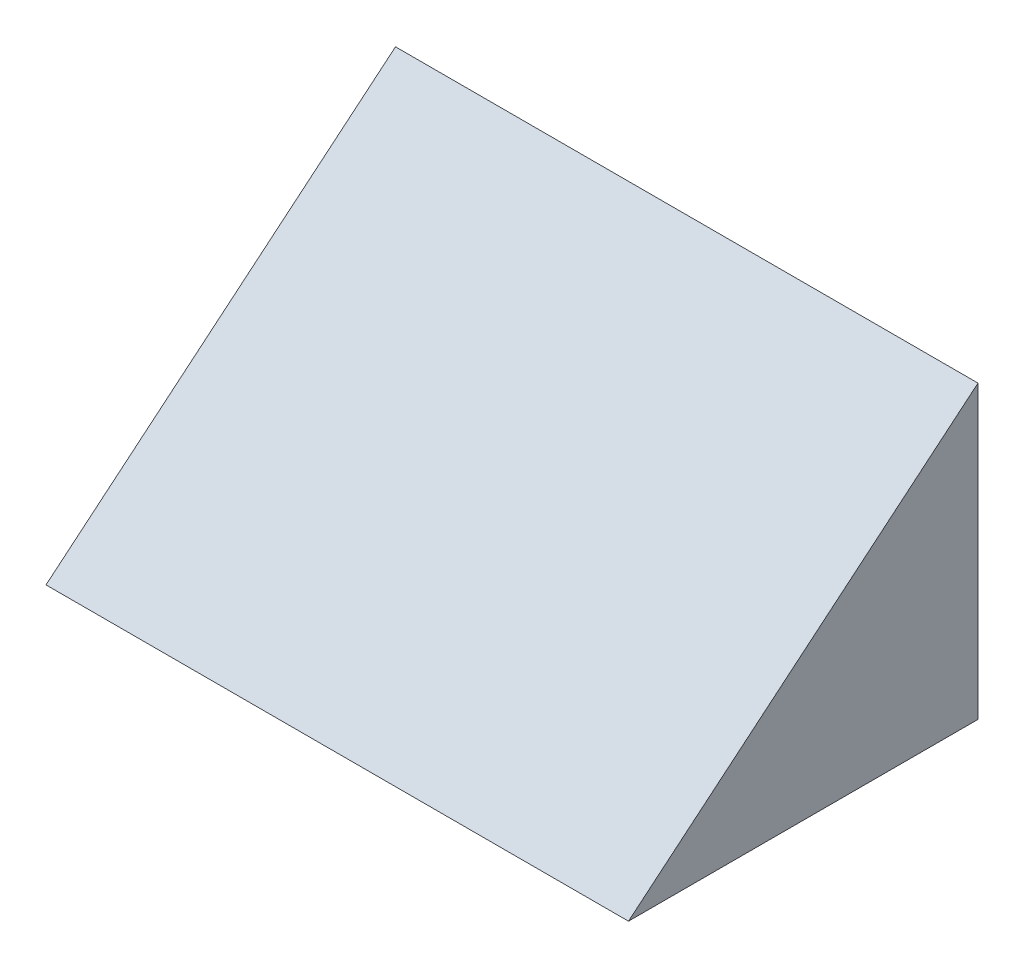
ISO-10303-21;
HEADER;
FILE_DESCRIPTION(('STEP AP214'),'2;1');
FILE_NAME('part.step','',(''),(''),'','','');
FILE_SCHEMA(('AUTOMOTIVE_DESIGN { 1 0 10303 214 1 1 1 1 }'));
ENDSEC;
DATA;
#1=APPLICATION_CONTEXT('core data for automotive mechanical design processes');
#2=APPLICATION_PROTOCOL_DEFINITION('international standard','automotive_design',2000,#1);
#3=PRODUCT_CONTEXT('',#1,'mechanical');
#4=PRODUCT('Part','Part','',(#3));
#5=PRODUCT_RELATED_PRODUCT_CATEGORY('part','',(#4));
#6=PRODUCT_DEFINITION_FORMATION('','',#4);
#7=PRODUCT_DEFINITION_CONTEXT('part definition',#1,'design');
#8=PRODUCT_DEFINITION('design','',#6,#7);
#9=PRODUCT_DEFINITION_SHAPE('','',#8);
#10=(LENGTH_UNIT() NAMED_UNIT(*) SI_UNIT(.MILLI.,.METRE.));
#11=(NAMED_UNIT(*) PLANE_ANGLE_UNIT() SI_UNIT($,.RADIAN.));
#12=(NAMED_UNIT(*) SI_UNIT($,.STERADIAN.) SOLID_ANGLE_UNIT());
#13=UNCERTAINTY_MEASURE_WITH_UNIT(LENGTH_MEASURE(1.E-05),#10,'distance_accuracy_value','');
#14=(GEOMETRIC_REPRESENTATION_CONTEXT(3) GLOBAL_UNCERTAINTY_ASSIGNED_CONTEXT((#13)) GLOBAL_UNIT_ASSIGNED_CONTEXT((#10,
#11,#12)) REPRESENTATION_CONTEXT('',''));
#15=CARTESIAN_POINT('',(0.,0.,0.));
#16=DIRECTION('',(0.,0.,1.));
#17=DIRECTION('',(1.,0.,0.));
#18=AXIS2_PLACEMENT_3D('',#15,#16,#17);
#19=CARTESIAN_POINT('',(200.,0.,120.));
#20=DIRECTION('',(0.,1.,0.));
#21=DIRECTION('',(0.,0.,1.));
#22=AXIS2_PLACEMENT_3D('',#19,#20,#21);
#23=PLANE('',#22);
#24=DIRECTION('',(0.,0.,-1.));
#25=VECTOR('',#24,1.);
#26=CARTESIAN_POINT('',(0.,0.,120.));
#27=LINE('',#26,#25);
#28=CARTESIAN_POINT('',(0.,0.,120.));
#29=VERTEX_POINT('',#28);
#30=CARTESIAN_POINT('',(0.,0.,0.));
#31=VERTEX_POINT('',#30);
#32=EDGE_CURVE('E80',#29,#31,#27,.T.);
#33=ORIENTED_EDGE('',*,*,#32,.T.);
#34=DIRECTION('',(-1.,0.,0.));
#35=VECTOR('',#34,1.);
#36=CARTESIAN_POINT('',(200.,0.,0.));
#37=LINE('',#36,#35);
#38=CARTESIAN_POINT('',(200.,0.,0.));
#39=VERTEX_POINT('',#38);
#40=EDGE_CURVE('E11',#39,#31,#37,.T.);
#41=ORIENTED_EDGE('',*,*,#40,.F.);
#42=DIRECTION('',(0.,0.,-1.));
#43=VECTOR('',#42,1.);
#44=CARTESIAN_POINT('',(200.,0.,120.));
#45=LINE('',#44,#43);
#46=CARTESIAN_POINT('',(200.,0.,120.));
#47=VERTEX_POINT('',#46);
#48=EDGE_CURVE('E73',#47,#39,#45,.T.);
#49=ORIENTED_EDGE('',*,*,#48,.F.);
#50=DIRECTION('',(-1.,0.,0.));
#51=VECTOR('',#50,1.);
#52=CARTESIAN_POINT('',(200.,0.,120.));
#53=LINE('',#52,#51);
#54=EDGE_CURVE('E81',#47,#29,#53,.T.);
#55=ORIENTED_EDGE('',*,*,#54,.T.);
#56=EDGE_LOOP('',(#33,#41,#49,#55));
#57=FACE_BOUND('',#56,.T.);
#58=ADVANCED_FACE('F33',(#57),#23,.F.);
#59=CARTESIAN_POINT('',(200.,0.,0.));
#60=DIRECTION('',(0.,0.,1.));
#61=DIRECTION('',(1.,0.,0.));
#62=AXIS2_PLACEMENT_3D('',#59,#60,#61);
#63=PLANE('',#62);
#64=DIRECTION('',(0.,1.,0.));
#65=VECTOR('',#64,1.);
#66=CARTESIAN_POINT('',(0.,0.,0.));
#67=LINE('',#66,#65);
#68=CARTESIAN_POINT('',(0.,100.,0.));
#69=VERTEX_POINT('',#68);
#70=EDGE_CURVE('E61',#31,#69,#67,.T.);
#71=ORIENTED_EDGE('',*,*,#70,.T.);
#72=DIRECTION('',(-1.,0.,0.));
#73=VECTOR('',#72,1.);
#74=CARTESIAN_POINT('',(200.,100.,0.));
#75=LINE('',#74,#73);
#76=CARTESIAN_POINT('',(200.,100.,0.));
#77=VERTEX_POINT('',#76);
#78=EDGE_CURVE('E41',#77,#69,#75,.T.);
#79=ORIENTED_EDGE('',*,*,#78,.F.);
#80=DIRECTION('',(0.,1.,0.));
#81=VECTOR('',#80,1.);
#82=CARTESIAN_POINT('',(200.,0.,0.));
#83=LINE('',#82,#81);
#84=EDGE_CURVE('E69',#39,#77,#83,.T.);
#85=ORIENTED_EDGE('',*,*,#84,.F.);
#86=ORIENTED_EDGE('',*,*,#40,.T.);
#87=EDGE_LOOP('',(#71,#79,#85,#86));
#88=FACE_BOUND('',#87,.T.);
#89=ADVANCED_FACE('F70',(#88),#63,.F.);
#90=CARTESIAN_POINT('',(200.,100.,0.));
#91=DIRECTION('',(0.,-0.768221279597376,-0.64018439966448));
#92=DIRECTION('',(0.,0.64018439966448,-0.768221279597376));
#93=AXIS2_PLACEMENT_3D('',#90,#91,#92);
#94=PLANE('',#93);
#95=DIRECTION('',(0.,-0.64018439966448,0.768221279597376));
#96=VECTOR('',#95,1.);
#97=CARTESIAN_POINT('',(0.,100.,0.));
#98=LINE('',#97,#96);
#99=EDGE_CURVE('E66',#69,#29,#98,.T.);
#100=ORIENTED_EDGE('',*,*,#99,.T.);
#101=ORIENTED_EDGE('',*,*,#54,.F.);
#102=DIRECTION('',(0.,-0.64018439966448,0.768221279597376));
#103=VECTOR('',#102,1.);
#104=CARTESIAN_POINT('',(200.,100.,0.));
#105=LINE('',#104,#103);
#106=EDGE_CURVE('E49',#77,#47,#105,.T.);
#107=ORIENTED_EDGE('',*,*,#106,.F.);
#108=ORIENTED_EDGE('',*,*,#78,.T.);
#109=EDGE_LOOP('',(#100,#101,#107,#108));
#110=FACE_BOUND('',#109,.T.);
#111=ADVANCED_FACE('F88',(#110),#94,.F.);
#112=CARTESIAN_POINT('',(200.,0.,0.));
#113=DIRECTION('',(1.,0.,0.));
#114=DIRECTION('',(0.,0.,-1.));
#115=AXIS2_PLACEMENT_3D('',#112,#113,#114);
#116=PLANE('',#115);
#117=ORIENTED_EDGE('',*,*,#48,.T.);
#118=ORIENTED_EDGE('',*,*,#84,.T.);
#119=ORIENTED_EDGE('',*,*,#106,.T.);
#120=EDGE_LOOP('',(#117,#118,#119));
#121=FACE_BOUND('',#120,.T.);
#122=ADVANCED_FACE('F76',(#121),#116,.T.);
#123=CARTESIAN_POINT('',(0.,0.,0.));
#124=DIRECTION('',(1.,0.,0.));
#125=DIRECTION('',(0.,0.,-1.));
#126=AXIS2_PLACEMENT_3D('',#123,#124,#125);
#127=PLANE('',#126);
#128=ORIENTED_EDGE('',*,*,#32,.F.);
#129=ORIENTED_EDGE('',*,*,#99,.F.);
#130=ORIENTED_EDGE('',*,*,#70,.F.);
#131=EDGE_LOOP('',(#128,#129,#130));
#132=FACE_BOUND('',#131,.T.);
#133=ADVANCED_FACE('F89',(#132),#127,.F.);
#134=CLOSED_SHELL('',(#58,#89,#111,#122,#133));
#135=MANIFOLD_SOLID_BREP('B2',#134);
#136=ADVANCED_BREP_SHAPE_REPRESENTATION('',(#18,#135),#14);
#137=SHAPE_DEFINITION_REPRESENTATION(#9,#136);
ENDSEC;
END-ISO-10303-21;
